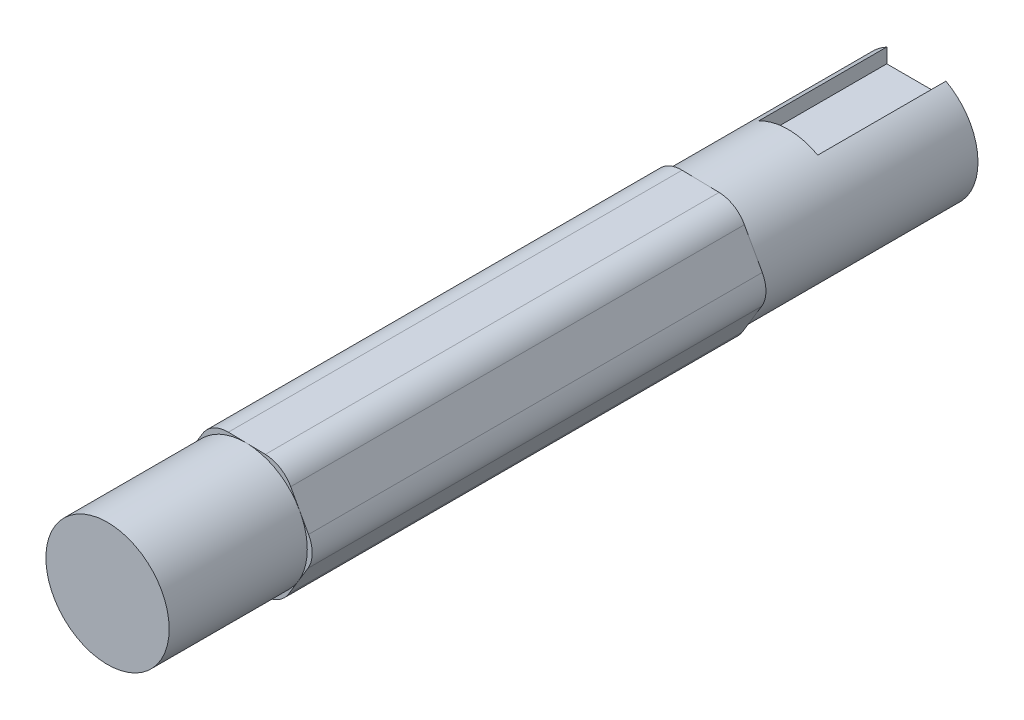
ISO-10303-21;
HEADER;
FILE_DESCRIPTION(('STEP AP214'),'2;1');
FILE_NAME('part.step','',(''),(''),'','','');
FILE_SCHEMA(('AUTOMOTIVE_DESIGN { 1 0 10303 214 1 1 1 1 }'));
ENDSEC;
DATA;
#1=APPLICATION_CONTEXT('core data for automotive mechanical design processes');
#2=APPLICATION_PROTOCOL_DEFINITION('international standard','automotive_design',2000,#1);
#3=PRODUCT_CONTEXT('',#1,'mechanical');
#4=PRODUCT('Part','Part','',(#3));
#5=PRODUCT_RELATED_PRODUCT_CATEGORY('part','',(#4));
#6=PRODUCT_DEFINITION_FORMATION('','',#4);
#7=PRODUCT_DEFINITION_CONTEXT('part definition',#1,'design');
#8=PRODUCT_DEFINITION('design','',#6,#7);
#9=PRODUCT_DEFINITION_SHAPE('','',#8);
#10=(LENGTH_UNIT() NAMED_UNIT(*) SI_UNIT(.MILLI.,.METRE.));
#11=(NAMED_UNIT(*) PLANE_ANGLE_UNIT() SI_UNIT($,.RADIAN.));
#12=(NAMED_UNIT(*) SI_UNIT($,.STERADIAN.) SOLID_ANGLE_UNIT());
#13=UNCERTAINTY_MEASURE_WITH_UNIT(LENGTH_MEASURE(1.E-05),#10,'distance_accuracy_value','');
#14=(GEOMETRIC_REPRESENTATION_CONTEXT(3) GLOBAL_UNCERTAINTY_ASSIGNED_CONTEXT((#13)) GLOBAL_UNIT_ASSIGNED_CONTEXT((#10,
#11,#12)) REPRESENTATION_CONTEXT('',''));
#15=CARTESIAN_POINT('',(0.,0.,0.));
#16=DIRECTION('',(0.,0.,1.));
#17=DIRECTION('',(1.,0.,0.));
#18=AXIS2_PLACEMENT_3D('',#15,#16,#17);
#19=CARTESIAN_POINT('',(0.,0.,-45.));
#20=DIRECTION('',(0.,0.,1.));
#21=DIRECTION('',(1.,0.,0.));
#22=AXIS2_PLACEMENT_3D('',#19,#20,#21);
#23=CYLINDRICAL_SURFACE('',#22,6.25);
#24=DIRECTION('',(0.,0.,1.));
#25=VECTOR('',#24,1.);
#26=CARTESIAN_POINT('',(3.,5.48292804986533,-45.));
#27=LINE('',#26,#25);
#28=CARTESIAN_POINT('',(3.,5.48292804986533,-32.));
#29=VERTEX_POINT('',#28);
#30=CARTESIAN_POINT('',(3.,5.48292804986533,-45.));
#31=VERTEX_POINT('',#30);
#32=EDGE_CURVE('E253',#29,#31,#27,.F.);
#33=ORIENTED_EDGE('',*,*,#32,.F.);
#34=CARTESIAN_POINT('',(0.,0.,-32.));
#35=DIRECTION('',(0.,0.,-1.));
#36=DIRECTION('',(-1.,0.,0.));
#37=AXIS2_PLACEMENT_3D('',#34,#35,#36);
#38=CIRCLE('',#37,6.25);
#39=CARTESIAN_POINT('',(-3.,5.48292804986533,-32.));
#40=VERTEX_POINT('',#39);
#41=EDGE_CURVE('E223',#29,#40,#38,.F.);
#42=ORIENTED_EDGE('',*,*,#41,.T.);
#43=DIRECTION('',(0.,0.,1.));
#44=VECTOR('',#43,1.);
#45=CARTESIAN_POINT('',(-3.,5.48292804986533,-45.));
#46=LINE('',#45,#44);
#47=CARTESIAN_POINT('',(-3.,5.48292804986533,-45.));
#48=VERTEX_POINT('',#47);
#49=EDGE_CURVE('E250',#48,#40,#46,.T.);
#50=ORIENTED_EDGE('',*,*,#49,.F.);
#51=CARTESIAN_POINT('',(0.,0.,-45.));
#52=DIRECTION('',(0.,0.,1.));
#53=DIRECTION('',(1.,0.,0.));
#54=AXIS2_PLACEMENT_3D('',#51,#52,#53);
#55=CIRCLE('',#54,6.25);
#56=EDGE_CURVE('E258',#48,#31,#55,.T.);
#57=ORIENTED_EDGE('',*,*,#56,.T.);
#58=EDGE_LOOP('',(#33,#42,#50,#57));
#59=FACE_BOUND('',#58,.T.);
#60=CARTESIAN_POINT('',(0.,0.,-23.));
#61=DIRECTION('',(0.,0.,1.));
#62=DIRECTION('',(1.,0.,0.));
#63=AXIS2_PLACEMENT_3D('',#60,#61,#62);
#64=CIRCLE('',#63,6.25);
#65=CARTESIAN_POINT('',(5.4741641454902,3.01596202035596,-23.));
#66=VERTEX_POINT('',#65);
#67=CARTESIAN_POINT('',(5.3489817992224,-3.23278420430246,-23.));
#68=VERTEX_POINT('',#67);
#69=EDGE_CURVE('E214',#66,#68,#64,.F.);
#70=ORIENTED_EDGE('',*,*,#69,.T.);
#71=CARTESIAN_POINT('',(-0.125182346267798,-6.24874622465843,-23.));
#72=VERTEX_POINT('',#71);
#73=EDGE_CURVE('E269',#68,#72,#64,.F.);
#74=ORIENTED_EDGE('',*,*,#73,.T.);
#75=CARTESIAN_POINT('',(-5.47416414549019,-3.01596202035596,-23.));
#76=VERTEX_POINT('',#75);
#77=EDGE_CURVE('E479',#72,#76,#64,.F.);
#78=ORIENTED_EDGE('',*,*,#77,.T.);
#79=CARTESIAN_POINT('',(-5.3489817992224,3.23278420430246,-23.));
#80=VERTEX_POINT('',#79);
#81=EDGE_CURVE('E486',#76,#80,#64,.F.);
#82=ORIENTED_EDGE('',*,*,#81,.T.);
#83=CARTESIAN_POINT('',(0.125182346267799,6.24874622465842,-23.));
#84=VERTEX_POINT('',#83);
#85=EDGE_CURVE('E458',#80,#84,#64,.F.);
#86=ORIENTED_EDGE('',*,*,#85,.T.);
#87=EDGE_CURVE('E268',#84,#66,#64,.F.);
#88=ORIENTED_EDGE('',*,*,#87,.T.);
#89=EDGE_LOOP('',(#70,#74,#78,#82,#86,#88));
#90=FACE_BOUND('',#89,.T.);
#91=ADVANCED_FACE('F38',(#59,#90),#23,.T.);
#92=CARTESIAN_POINT('',(0.,0.,-45.));
#93=DIRECTION('',(0.,0.,1.));
#94=DIRECTION('',(1.,0.,0.));
#95=AXIS2_PLACEMENT_3D('',#92,#93,#94);
#96=PLANE('',#95);
#97=DIRECTION('',(-1.,0.,0.));
#98=VECTOR('',#97,1.);
#99=CARTESIAN_POINT('',(3.,4.,-45.));
#100=LINE('',#99,#98);
#101=CARTESIAN_POINT('',(3.,4.,-45.));
#102=VERTEX_POINT('',#101);
#103=CARTESIAN_POINT('',(-3.,4.,-45.));
#104=VERTEX_POINT('',#103);
#105=EDGE_CURVE('E243',#102,#104,#100,.T.);
#106=ORIENTED_EDGE('',*,*,#105,.F.);
#107=DIRECTION('',(0.,1.,0.));
#108=VECTOR('',#107,1.);
#109=CARTESIAN_POINT('',(3.,0.,-45.));
#110=LINE('',#109,#108);
#111=EDGE_CURVE('E261',#102,#31,#110,.T.);
#112=ORIENTED_EDGE('',*,*,#111,.T.);
#113=ORIENTED_EDGE('',*,*,#56,.F.);
#114=DIRECTION('',(0.,1.,0.));
#115=VECTOR('',#114,1.);
#116=CARTESIAN_POINT('',(-3.,8.5,-45.));
#117=LINE('',#116,#115);
#118=EDGE_CURVE('E236',#104,#48,#117,.T.);
#119=ORIENTED_EDGE('',*,*,#118,.F.);
#120=EDGE_LOOP('',(#106,#112,#113,#119));
#121=FACE_BOUND('',#120,.T.);
#122=ADVANCED_FACE('F332',(#121),#96,.F.);
#123=CARTESIAN_POINT('',(3.,8.5,-32.));
#124=DIRECTION('',(1.,0.,0.));
#125=DIRECTION('',(0.,0.,-1.));
#126=AXIS2_PLACEMENT_3D('',#123,#124,#125);
#127=PLANE('',#126);
#128=ORIENTED_EDGE('',*,*,#32,.T.);
#129=ORIENTED_EDGE('',*,*,#111,.F.);
#130=DIRECTION('',(0.,0.,-1.));
#131=VECTOR('',#130,1.);
#132=CARTESIAN_POINT('',(3.,4.,-32.));
#133=LINE('',#132,#131);
#134=CARTESIAN_POINT('',(3.,4.,-32.));
#135=VERTEX_POINT('',#134);
#136=EDGE_CURVE('E242',#135,#102,#133,.T.);
#137=ORIENTED_EDGE('',*,*,#136,.F.);
#138=DIRECTION('',(0.,-1.,0.));
#139=VECTOR('',#138,1.);
#140=CARTESIAN_POINT('',(3.,8.5,-32.));
#141=LINE('',#140,#139);
#142=EDGE_CURVE('E233',#29,#135,#141,.T.);
#143=ORIENTED_EDGE('',*,*,#142,.F.);
#144=EDGE_LOOP('',(#128,#129,#137,#143));
#145=FACE_BOUND('',#144,.T.);
#146=ADVANCED_FACE('F338',(#145),#127,.F.);
#147=CARTESIAN_POINT('',(-3.,8.5,-32.));
#148=DIRECTION('',(-1.,0.,0.));
#149=DIRECTION('',(0.,0.,1.));
#150=AXIS2_PLACEMENT_3D('',#147,#148,#149);
#151=PLANE('',#150);
#152=ORIENTED_EDGE('',*,*,#49,.T.);
#153=DIRECTION('',(0.,1.,0.));
#154=VECTOR('',#153,1.);
#155=CARTESIAN_POINT('',(-3.,8.5,-32.));
#156=LINE('',#155,#154);
#157=CARTESIAN_POINT('',(-3.,4.,-32.));
#158=VERTEX_POINT('',#157);
#159=EDGE_CURVE('E239',#158,#40,#156,.T.);
#160=ORIENTED_EDGE('',*,*,#159,.F.);
#161=DIRECTION('',(0.,0.,-1.));
#162=VECTOR('',#161,1.);
#163=CARTESIAN_POINT('',(-3.,4.,-32.));
#164=LINE('',#163,#162);
#165=EDGE_CURVE('E248',#158,#104,#164,.T.);
#166=ORIENTED_EDGE('',*,*,#165,.T.);
#167=ORIENTED_EDGE('',*,*,#118,.T.);
#168=EDGE_LOOP('',(#152,#160,#166,#167));
#169=FACE_BOUND('',#168,.T.);
#170=ADVANCED_FACE('F364',(#169),#151,.F.);
#171=CARTESIAN_POINT('',(3.,4.,-32.));
#172=DIRECTION('',(0.,-1.,0.));
#173=DIRECTION('',(0.,0.,-1.));
#174=AXIS2_PLACEMENT_3D('',#171,#172,#173);
#175=PLANE('',#174);
#176=ORIENTED_EDGE('',*,*,#105,.T.);
#177=ORIENTED_EDGE('',*,*,#165,.F.);
#178=DIRECTION('',(-1.,0.,0.));
#179=VECTOR('',#178,1.);
#180=CARTESIAN_POINT('',(3.,4.,-32.));
#181=LINE('',#180,#179);
#182=EDGE_CURVE('E235',#135,#158,#181,.T.);
#183=ORIENTED_EDGE('',*,*,#182,.F.);
#184=ORIENTED_EDGE('',*,*,#136,.T.);
#185=EDGE_LOOP('',(#176,#177,#183,#184));
#186=FACE_BOUND('',#185,.T.);
#187=ADVANCED_FACE('F366',(#186),#175,.F.);
#188=CARTESIAN_POINT('',(0.,0.,-32.));
#189=DIRECTION('',(0.,0.,-1.));
#190=DIRECTION('',(-1.,0.,0.));
#191=AXIS2_PLACEMENT_3D('',#188,#189,#190);
#192=PLANE('',#191);
#193=ORIENTED_EDGE('',*,*,#142,.T.);
#194=ORIENTED_EDGE('',*,*,#182,.T.);
#195=ORIENTED_EDGE('',*,*,#159,.T.);
#196=ORIENTED_EDGE('',*,*,#41,.F.);
#197=EDGE_LOOP('',(#193,#194,#195,#196));
#198=FACE_BOUND('',#197,.T.);
#199=ADVANCED_FACE('F369',(#198),#192,.T.);
#200=CARTESIAN_POINT('',(7.2154306298084,-0.144548122631002,42.1851751755642));
#201=DIRECTION('',(-0.875866263278431,-0.482553923256953,0.));
#202=DIRECTION('',(0.482553923256953,-0.875866263278431,0.));
#203=AXIS2_PLACEMENT_3D('',#200,#201,#202);
#204=PLANE('',#203);
#205=DIRECTION('',(-0.482553923256953,0.875866263278431,0.));
#206=VECTOR('',#205,1.);
#207=CARTESIAN_POINT('',(7.2154306298084,-0.144548122631002,23.));
#208=LINE('',#207,#206);
#209=CARTESIAN_POINT('',(6.37962271733566,1.37249674600274,23.));
#210=VERTEX_POINT('',#209);
#211=CARTESIAN_POINT('',(5.4741641454902,3.01596202035596,23.));
#212=VERTEX_POINT('',#211);
#213=EDGE_CURVE('E221',#210,#212,#208,.T.);
#214=ORIENTED_EDGE('',*,*,#213,.F.);
#215=DIRECTION('',(0.,0.,-1.));
#216=VECTOR('',#215,1.);
#217=CARTESIAN_POINT('',(6.37962271733566,1.37249674600274,42.1851751755642));
#218=LINE('',#217,#216);
#219=CARTESIAN_POINT('',(6.37962271733566,1.37249674600274,-23.));
#220=VERTEX_POINT('',#219);
#221=EDGE_CURVE('E310',#210,#220,#218,.T.);
#222=ORIENTED_EDGE('',*,*,#221,.T.);
#223=DIRECTION('',(-0.482553923256953,0.875866263278431,0.));
#224=VECTOR('',#223,1.);
#225=CARTESIAN_POINT('',(7.2154306298084,-0.144548122631002,-23.));
#226=LINE('',#225,#224);
#227=EDGE_CURVE('E429',#220,#66,#226,.T.);
#228=ORIENTED_EDGE('',*,*,#227,.T.);
#229=CARTESIAN_POINT('',(4.56870557364473,4.65942729470918,-23.));
#230=VERTEX_POINT('',#229);
#231=EDGE_CURVE('E433',#66,#230,#226,.T.);
#232=ORIENTED_EDGE('',*,*,#231,.T.);
#233=DIRECTION('',(0.,0.,-1.));
#234=VECTOR('',#233,1.);
#235=CARTESIAN_POINT('',(4.56870557364473,4.65942729470918,42.1851751755642));
#236=LINE('',#235,#234);
#237=CARTESIAN_POINT('',(4.56870557364473,4.65942729470918,23.));
#238=VERTEX_POINT('',#237);
#239=EDGE_CURVE('E308',#230,#238,#236,.F.);
#240=ORIENTED_EDGE('',*,*,#239,.T.);
#241=EDGE_CURVE('E199',#212,#238,#208,.T.);
#242=ORIENTED_EDGE('',*,*,#241,.F.);
#243=EDGE_LOOP('',(#214,#222,#228,#232,#240,#242));
#244=FACE_BOUND('',#243,.T.);
#245=ADVANCED_FACE('F316',(#244),#204,.F.);
#246=CARTESIAN_POINT('',(3.732897661172,6.17647216334292,42.1851751755642));
#247=DIRECTION('',(-0.0200291754028479,-0.999799395945348,0.));
#248=DIRECTION('',(0.999799395945348,-0.0200291754028479,0.));
#249=AXIS2_PLACEMENT_3D('',#246,#247,#248);
#250=PLANE('',#249);
#251=DIRECTION('',(-0.999799395945348,0.0200291754028479,0.));
#252=VECTOR('',#251,1.);
#253=CARTESIAN_POINT('',(3.732897661172,6.17647216334292,-23.));
#254=LINE('',#253,#252);
#255=CARTESIAN_POINT('',(-1.75082961748238,6.28632873654248,-23.));
#256=VERTEX_POINT('',#255);
#257=EDGE_CURVE('E424',#84,#256,#254,.T.);
#258=ORIENTED_EDGE('',*,*,#257,.T.);
#259=DIRECTION('',(0.,0.,-1.));
#260=VECTOR('',#259,1.);
#261=CARTESIAN_POINT('',(-1.75082961748238,6.28632873654248,42.1851751755642));
#262=LINE('',#261,#260);
#263=CARTESIAN_POINT('',(-1.75082961748238,6.28632873654248,23.));
#264=VERTEX_POINT('',#263);
#265=EDGE_CURVE('E280',#256,#264,#262,.F.);
#266=ORIENTED_EDGE('',*,*,#265,.T.);
#267=DIRECTION('',(-0.999799395945348,0.0200291754028479,0.));
#268=VECTOR('',#267,1.);
#269=CARTESIAN_POINT('',(3.732897661172,6.17647216334292,23.));
#270=LINE('',#269,#268);
#271=CARTESIAN_POINT('',(0.125182346267799,6.24874622465842,23.));
#272=VERTEX_POINT('',#271);
#273=EDGE_CURVE('E319',#272,#264,#270,.T.);
#274=ORIENTED_EDGE('',*,*,#273,.F.);
#275=CARTESIAN_POINT('',(2.00119431001798,6.21116371277436,23.));
#276=VERTEX_POINT('',#275);
#277=EDGE_CURVE('E441',#276,#272,#270,.T.);
#278=ORIENTED_EDGE('',*,*,#277,.F.);
#279=DIRECTION('',(0.,0.,-1.));
#280=VECTOR('',#279,1.);
#281=CARTESIAN_POINT('',(2.00119431001798,6.21116371277436,42.1851751755642));
#282=LINE('',#281,#280);
#283=CARTESIAN_POINT('',(2.00119431001798,6.21116371277436,-23.));
#284=VERTEX_POINT('',#283);
#285=EDGE_CURVE('E277',#276,#284,#282,.T.);
#286=ORIENTED_EDGE('',*,*,#285,.T.);
#287=EDGE_CURVE('E419',#284,#84,#254,.T.);
#288=ORIENTED_EDGE('',*,*,#287,.T.);
#289=EDGE_LOOP('',(#258,#266,#274,#278,#286,#288));
#290=FACE_BOUND('',#289,.T.);
#291=ADVANCED_FACE('F379',(#290),#250,.F.);
#292=CARTESIAN_POINT('',(-3.4825329686364,6.32102028597393,42.1851751755642));
#293=DIRECTION('',(0.855837087875584,-0.517245472688394,0.));
#294=DIRECTION('',(0.517245472688394,0.855837087875584,0.));
#295=AXIS2_PLACEMENT_3D('',#292,#293,#294);
#296=PLANE('',#295);
#297=DIRECTION('',(-0.517245472688394,-0.855837087875584,0.));
#298=VECTOR('',#297,1.);
#299=CARTESIAN_POINT('',(-3.4825329686364,6.32102028597393,23.));
#300=LINE('',#299,#298);
#301=CARTESIAN_POINT('',(-4.37842840731768,4.83866696677162,23.));
#302=VERTEX_POINT('',#301);
#303=CARTESIAN_POINT('',(-5.3489817992224,3.23278420430246,23.));
#304=VERTEX_POINT('',#303);
#305=EDGE_CURVE('E439',#302,#304,#300,.T.);
#306=ORIENTED_EDGE('',*,*,#305,.F.);
#307=DIRECTION('',(0.,0.,-1.));
#308=VECTOR('',#307,1.);
#309=CARTESIAN_POINT('',(-4.37842840731768,4.83866696677162,42.1851751755642));
#310=LINE('',#309,#308);
#311=CARTESIAN_POINT('',(-4.37842840731768,4.83866696677162,-23.));
#312=VERTEX_POINT('',#311);
#313=EDGE_CURVE('E272',#302,#312,#310,.T.);
#314=ORIENTED_EDGE('',*,*,#313,.T.);
#315=DIRECTION('',(-0.517245472688394,-0.855837087875584,0.));
#316=VECTOR('',#315,1.);
#317=CARTESIAN_POINT('',(-3.4825329686364,6.32102028597393,-23.));
#318=LINE('',#317,#316);
#319=EDGE_CURVE('E427',#312,#80,#318,.T.);
#320=ORIENTED_EDGE('',*,*,#319,.T.);
#321=CARTESIAN_POINT('',(-6.31953519112711,1.6269014418333,-23.));
#322=VERTEX_POINT('',#321);
#323=EDGE_CURVE('E423',#80,#322,#318,.T.);
#324=ORIENTED_EDGE('',*,*,#323,.T.);
#325=DIRECTION('',(0.,0.,-1.));
#326=VECTOR('',#325,1.);
#327=CARTESIAN_POINT('',(-6.31953519112711,1.6269014418333,42.1851751755642));
#328=LINE('',#327,#326);
#329=CARTESIAN_POINT('',(-6.31953519112711,1.6269014418333,23.));
#330=VERTEX_POINT('',#329);
#331=EDGE_CURVE('E270',#322,#330,#328,.F.);
#332=ORIENTED_EDGE('',*,*,#331,.T.);
#333=EDGE_CURVE('E440',#304,#330,#300,.T.);
#334=ORIENTED_EDGE('',*,*,#333,.F.);
#335=EDGE_LOOP('',(#306,#314,#320,#324,#332,#334));
#336=FACE_BOUND('',#335,.T.);
#337=ADVANCED_FACE('F382',(#336),#296,.F.);
#338=CARTESIAN_POINT('',(-7.21543062980839,0.144548122631002,42.1851751755642));
#339=DIRECTION('',(0.875866263278431,0.482553923256954,0.));
#340=DIRECTION('',(-0.482553923256954,0.875866263278431,0.));
#341=AXIS2_PLACEMENT_3D('',#338,#339,#340);
#342=PLANE('',#341);
#343=DIRECTION('',(0.482553923256954,-0.875866263278431,0.));
#344=VECTOR('',#343,1.);
#345=CARTESIAN_POINT('',(-7.21543062980839,0.144548122631002,23.));
#346=LINE('',#345,#344);
#347=CARTESIAN_POINT('',(-6.37962271733566,-1.37249674600274,23.));
#348=VERTEX_POINT('',#347);
#349=CARTESIAN_POINT('',(-5.47416414549019,-3.01596202035596,23.));
#350=VERTEX_POINT('',#349);
#351=EDGE_CURVE('E436',#348,#350,#346,.T.);
#352=ORIENTED_EDGE('',*,*,#351,.F.);
#353=DIRECTION('',(0.,0.,-1.));
#354=VECTOR('',#353,1.);
#355=CARTESIAN_POINT('',(-6.37962271733566,-1.37249674600274,42.1851751755642));
#356=LINE('',#355,#354);
#357=CARTESIAN_POINT('',(-6.37962271733566,-1.37249674600274,-23.));
#358=VERTEX_POINT('',#357);
#359=EDGE_CURVE('E286',#348,#358,#356,.T.);
#360=ORIENTED_EDGE('',*,*,#359,.T.);
#361=DIRECTION('',(0.482553923256954,-0.875866263278431,0.));
#362=VECTOR('',#361,1.);
#363=CARTESIAN_POINT('',(-7.21543062980839,0.144548122631002,-23.));
#364=LINE('',#363,#362);
#365=EDGE_CURVE('E462',#358,#76,#364,.T.);
#366=ORIENTED_EDGE('',*,*,#365,.T.);
#367=CARTESIAN_POINT('',(-4.56870557364473,-4.65942729470918,-23.));
#368=VERTEX_POINT('',#367);
#369=EDGE_CURVE('E460',#76,#368,#364,.T.);
#370=ORIENTED_EDGE('',*,*,#369,.T.);
#371=DIRECTION('',(0.,0.,-1.));
#372=VECTOR('',#371,1.);
#373=CARTESIAN_POINT('',(-4.56870557364473,-4.65942729470918,42.1851751755642));
#374=LINE('',#373,#372);
#375=CARTESIAN_POINT('',(-4.56870557364473,-4.65942729470918,23.));
#376=VERTEX_POINT('',#375);
#377=EDGE_CURVE('E284',#368,#376,#374,.F.);
#378=ORIENTED_EDGE('',*,*,#377,.T.);
#379=EDGE_CURVE('E438',#350,#376,#346,.T.);
#380=ORIENTED_EDGE('',*,*,#379,.F.);
#381=EDGE_LOOP('',(#352,#360,#366,#370,#378,#380));
#382=FACE_BOUND('',#381,.T.);
#383=ADVANCED_FACE('F386',(#382),#342,.F.);
#384=CARTESIAN_POINT('',(-3.73289766117199,-6.17647216334292,42.1851751755642));
#385=DIRECTION('',(0.0200291754028477,0.999799395945348,0.));
#386=DIRECTION('',(-0.999799395945348,0.0200291754028477,0.));
#387=AXIS2_PLACEMENT_3D('',#384,#385,#386);
#388=PLANE('',#387);
#389=DIRECTION('',(0.999799395945348,-0.0200291754028477,0.));
#390=VECTOR('',#389,1.);
#391=CARTESIAN_POINT('',(-3.73289766117199,-6.17647216334292,23.));
#392=LINE('',#391,#390);
#393=CARTESIAN_POINT('',(-2.00119431001797,-6.21116371277436,23.));
#394=VERTEX_POINT('',#393);
#395=CARTESIAN_POINT('',(-0.125182346267798,-6.24874622465843,23.));
#396=VERTEX_POINT('',#395);
#397=EDGE_CURVE('E246',#394,#396,#392,.T.);
#398=ORIENTED_EDGE('',*,*,#397,.F.);
#399=DIRECTION('',(0.,0.,-1.));
#400=VECTOR('',#399,1.);
#401=CARTESIAN_POINT('',(-2.00119431001797,-6.21116371277436,42.1851751755642));
#402=LINE('',#401,#400);
#403=CARTESIAN_POINT('',(-2.00119431001797,-6.21116371277436,-23.));
#404=VERTEX_POINT('',#403);
#405=EDGE_CURVE('E295',#394,#404,#402,.T.);
#406=ORIENTED_EDGE('',*,*,#405,.T.);
#407=DIRECTION('',(0.999799395945348,-0.0200291754028477,0.));
#408=VECTOR('',#407,1.);
#409=CARTESIAN_POINT('',(-3.73289766117199,-6.17647216334292,-23.));
#410=LINE('',#409,#408);
#411=EDGE_CURVE('E467',#404,#72,#410,.T.);
#412=ORIENTED_EDGE('',*,*,#411,.T.);
#413=CARTESIAN_POINT('',(1.75082961748238,-6.28632873654249,-23.));
#414=VERTEX_POINT('',#413);
#415=EDGE_CURVE('E465',#72,#414,#410,.T.);
#416=ORIENTED_EDGE('',*,*,#415,.T.);
#417=DIRECTION('',(0.,0.,-1.));
#418=VECTOR('',#417,1.);
#419=CARTESIAN_POINT('',(1.75082961748238,-6.28632873654249,42.1851751755642));
#420=LINE('',#419,#418);
#421=CARTESIAN_POINT('',(1.75082961748238,-6.28632873654249,23.));
#422=VERTEX_POINT('',#421);
#423=EDGE_CURVE('E293',#414,#422,#420,.F.);
#424=ORIENTED_EDGE('',*,*,#423,.T.);
#425=EDGE_CURVE('E435',#396,#422,#392,.T.);
#426=ORIENTED_EDGE('',*,*,#425,.F.);
#427=EDGE_LOOP('',(#398,#406,#412,#416,#424,#426));
#428=FACE_BOUND('',#427,.T.);
#429=ADVANCED_FACE('F390',(#428),#388,.F.);
#430=CARTESIAN_POINT('',(3.4825329686364,-6.32102028597393,42.1851751755642));
#431=DIRECTION('',(-0.855837087875584,0.517245472688394,0.));
#432=DIRECTION('',(-0.517245472688394,-0.855837087875584,0.));
#433=AXIS2_PLACEMENT_3D('',#430,#431,#432);
#434=PLANE('',#433);
#435=DIRECTION('',(0.517245472688394,0.855837087875584,0.));
#436=VECTOR('',#435,1.);
#437=CARTESIAN_POINT('',(3.4825329686364,-6.32102028597393,23.));
#438=LINE('',#437,#436);
#439=CARTESIAN_POINT('',(4.37842840731768,-4.83866696677163,23.));
#440=VERTEX_POINT('',#439);
#441=CARTESIAN_POINT('',(5.3489817992224,-3.23278420430246,23.));
#442=VERTEX_POINT('',#441);
#443=EDGE_CURVE('E187',#440,#442,#438,.T.);
#444=ORIENTED_EDGE('',*,*,#443,.F.);
#445=DIRECTION('',(0.,0.,-1.));
#446=VECTOR('',#445,1.);
#447=CARTESIAN_POINT('',(4.37842840731768,-4.83866696677163,42.1851751755642));
#448=LINE('',#447,#446);
#449=CARTESIAN_POINT('',(4.37842840731768,-4.83866696677163,-23.));
#450=VERTEX_POINT('',#449);
#451=EDGE_CURVE('E303',#440,#450,#448,.T.);
#452=ORIENTED_EDGE('',*,*,#451,.T.);
#453=DIRECTION('',(0.517245472688394,0.855837087875584,0.));
#454=VECTOR('',#453,1.);
#455=CARTESIAN_POINT('',(3.4825329686364,-6.32102028597393,-23.));
#456=LINE('',#455,#454);
#457=EDGE_CURVE('E227',#450,#68,#456,.T.);
#458=ORIENTED_EDGE('',*,*,#457,.T.);
#459=CARTESIAN_POINT('',(6.31953519112712,-1.6269014418333,-23.));
#460=VERTEX_POINT('',#459);
#461=EDGE_CURVE('E228',#68,#460,#456,.T.);
#462=ORIENTED_EDGE('',*,*,#461,.T.);
#463=DIRECTION('',(0.,0.,-1.));
#464=VECTOR('',#463,1.);
#465=CARTESIAN_POINT('',(6.31953519112712,-1.6269014418333,42.1851751755642));
#466=LINE('',#465,#464);
#467=CARTESIAN_POINT('',(6.31953519112712,-1.6269014418333,23.));
#468=VERTEX_POINT('',#467);
#469=EDGE_CURVE('E226',#460,#468,#466,.F.);
#470=ORIENTED_EDGE('',*,*,#469,.T.);
#471=EDGE_CURVE('E200',#442,#468,#438,.T.);
#472=ORIENTED_EDGE('',*,*,#471,.F.);
#473=EDGE_LOOP('',(#444,#452,#458,#462,#470,#472));
#474=FACE_BOUND('',#473,.T.);
#475=ADVANCED_FACE('F224',(#474),#434,.F.);
#476=CARTESIAN_POINT('',(0.,0.,-23.));
#477=DIRECTION('',(0.,0.,1.));
#478=DIRECTION('',(1.,0.,0.));
#479=AXIS2_PLACEMENT_3D('',#476,#477,#478);
#480=PLANE('',#479);
#481=ORIENTED_EDGE('',*,*,#457,.F.);
#482=CARTESIAN_POINT('',(1.81091714369093,-3.28693054870644,-23.));
#483=DIRECTION('',(0.,0.,1.));
#484=DIRECTION('',(1.,0.,0.));
#485=AXIS2_PLACEMENT_3D('',#482,#483,#484);
#486=CIRCLE('',#485,3.);
#487=EDGE_CURVE('E305',#450,#414,#486,.F.);
#488=ORIENTED_EDGE('',*,*,#487,.T.);
#489=ORIENTED_EDGE('',*,*,#415,.F.);
#490=ORIENTED_EDGE('',*,*,#73,.F.);
#491=EDGE_LOOP('',(#481,#488,#489,#490));
#492=FACE_BOUND('',#491,.T.);
#493=ADVANCED_FACE('F397',(#492),#480,.F.);
#494=ORIENTED_EDGE('',*,*,#411,.F.);
#495=CARTESIAN_POINT('',(-1.94110678380943,-3.21176552493832,-23.));
#496=DIRECTION('',(0.,0.,1.));
#497=DIRECTION('',(1.,0.,0.));
#498=AXIS2_PLACEMENT_3D('',#495,#496,#497);
#499=CIRCLE('',#498,3.);
#500=EDGE_CURVE('E298',#404,#368,#499,.F.);
#501=ORIENTED_EDGE('',*,*,#500,.T.);
#502=ORIENTED_EDGE('',*,*,#369,.F.);
#503=ORIENTED_EDGE('',*,*,#77,.F.);
#504=EDGE_LOOP('',(#494,#501,#502,#503));
#505=FACE_BOUND('',#504,.T.);
#506=ADVANCED_FACE('F407',(#505),#480,.F.);
#507=ORIENTED_EDGE('',*,*,#365,.F.);
#508=CARTESIAN_POINT('',(-3.75202392750036,0.0751650237681221,-23.));
#509=DIRECTION('',(0.,0.,1.));
#510=DIRECTION('',(1.,0.,0.));
#511=AXIS2_PLACEMENT_3D('',#508,#509,#510);
#512=CIRCLE('',#511,3.);
#513=EDGE_CURVE('E289',#358,#322,#512,.F.);
#514=ORIENTED_EDGE('',*,*,#513,.T.);
#515=ORIENTED_EDGE('',*,*,#323,.F.);
#516=ORIENTED_EDGE('',*,*,#81,.F.);
#517=EDGE_LOOP('',(#507,#514,#515,#516));
#518=FACE_BOUND('',#517,.T.);
#519=ADVANCED_FACE('F416',(#518),#480,.F.);
#520=ORIENTED_EDGE('',*,*,#319,.F.);
#521=CARTESIAN_POINT('',(-1.81091714369093,3.28693054870644,-23.));
#522=DIRECTION('',(0.,0.,1.));
#523=DIRECTION('',(1.,0.,0.));
#524=AXIS2_PLACEMENT_3D('',#521,#522,#523);
#525=CIRCLE('',#524,3.);
#526=EDGE_CURVE('E275',#312,#256,#525,.F.);
#527=ORIENTED_EDGE('',*,*,#526,.T.);
#528=ORIENTED_EDGE('',*,*,#257,.F.);
#529=ORIENTED_EDGE('',*,*,#85,.F.);
#530=EDGE_LOOP('',(#520,#527,#528,#529));
#531=FACE_BOUND('',#530,.T.);
#532=ADVANCED_FACE('F410',(#531),#480,.F.);
#533=ORIENTED_EDGE('',*,*,#287,.F.);
#534=CARTESIAN_POINT('',(1.94110678380944,3.21176552493832,-23.));
#535=DIRECTION('',(0.,0.,1.));
#536=DIRECTION('',(1.,0.,0.));
#537=AXIS2_PLACEMENT_3D('',#534,#535,#536);
#538=CIRCLE('',#537,3.);
#539=EDGE_CURVE('E46',#284,#230,#538,.F.);
#540=ORIENTED_EDGE('',*,*,#539,.T.);
#541=ORIENTED_EDGE('',*,*,#231,.F.);
#542=ORIENTED_EDGE('',*,*,#87,.F.);
#543=EDGE_LOOP('',(#533,#540,#541,#542));
#544=FACE_BOUND('',#543,.T.);
#545=ADVANCED_FACE('F400',(#544),#480,.F.);
#546=CARTESIAN_POINT('',(0.,0.,23.));
#547=DIRECTION('',(0.,0.,1.));
#548=DIRECTION('',(1.,0.,0.));
#549=AXIS2_PLACEMENT_3D('',#546,#547,#548);
#550=PLANE('',#549);
#551=ORIENTED_EDGE('',*,*,#425,.T.);
#552=CARTESIAN_POINT('',(1.81091714369093,-3.28693054870644,23.));
#553=DIRECTION('',(0.,0.,1.));
#554=DIRECTION('',(1.,0.,0.));
#555=AXIS2_PLACEMENT_3D('',#552,#553,#554);
#556=CIRCLE('',#555,3.);
#557=EDGE_CURVE('E194',#422,#440,#556,.T.);
#558=ORIENTED_EDGE('',*,*,#557,.T.);
#559=ORIENTED_EDGE('',*,*,#443,.T.);
#560=CARTESIAN_POINT('',(0.,0.,23.));
#561=DIRECTION('',(0.,0.,1.));
#562=DIRECTION('',(1.,0.,0.));
#563=AXIS2_PLACEMENT_3D('',#560,#561,#562);
#564=CIRCLE('',#563,6.25);
#565=EDGE_CURVE('E191',#442,#396,#564,.F.);
#566=ORIENTED_EDGE('',*,*,#565,.T.);
#567=EDGE_LOOP('',(#551,#558,#559,#566));
#568=FACE_BOUND('',#567,.T.);
#569=ADVANCED_FACE('F190',(#568),#550,.T.);
#570=ORIENTED_EDGE('',*,*,#379,.T.);
#571=CARTESIAN_POINT('',(-1.94110678380943,-3.21176552493832,23.));
#572=DIRECTION('',(0.,0.,1.));
#573=DIRECTION('',(1.,0.,0.));
#574=AXIS2_PLACEMENT_3D('',#571,#572,#573);
#575=CIRCLE('',#574,3.);
#576=EDGE_CURVE('E300',#376,#394,#575,.T.);
#577=ORIENTED_EDGE('',*,*,#576,.T.);
#578=ORIENTED_EDGE('',*,*,#397,.T.);
#579=EDGE_CURVE('E213',#396,#350,#564,.F.);
#580=ORIENTED_EDGE('',*,*,#579,.T.);
#581=EDGE_LOOP('',(#570,#577,#578,#580));
#582=FACE_BOUND('',#581,.T.);
#583=ADVANCED_FACE('F415',(#582),#550,.T.);
#584=ORIENTED_EDGE('',*,*,#333,.T.);
#585=CARTESIAN_POINT('',(-3.75202392750036,0.0751650237681221,23.));
#586=DIRECTION('',(0.,0.,1.));
#587=DIRECTION('',(1.,0.,0.));
#588=AXIS2_PLACEMENT_3D('',#585,#586,#587);
#589=CIRCLE('',#588,3.);
#590=EDGE_CURVE('E291',#330,#348,#589,.T.);
#591=ORIENTED_EDGE('',*,*,#590,.T.);
#592=ORIENTED_EDGE('',*,*,#351,.T.);
#593=EDGE_CURVE('E504',#350,#304,#564,.F.);
#594=ORIENTED_EDGE('',*,*,#593,.T.);
#595=EDGE_LOOP('',(#584,#591,#592,#594));
#596=FACE_BOUND('',#595,.T.);
#597=ADVANCED_FACE('F503',(#596),#550,.T.);
#598=ORIENTED_EDGE('',*,*,#273,.T.);
#599=CARTESIAN_POINT('',(-1.81091714369093,3.28693054870644,23.));
#600=DIRECTION('',(0.,0.,1.));
#601=DIRECTION('',(1.,0.,0.));
#602=AXIS2_PLACEMENT_3D('',#599,#600,#601);
#603=CIRCLE('',#602,3.);
#604=EDGE_CURVE('E282',#264,#302,#603,.T.);
#605=ORIENTED_EDGE('',*,*,#604,.T.);
#606=ORIENTED_EDGE('',*,*,#305,.T.);
#607=EDGE_CURVE('E451',#304,#272,#564,.F.);
#608=ORIENTED_EDGE('',*,*,#607,.T.);
#609=EDGE_LOOP('',(#598,#605,#606,#608));
#610=FACE_BOUND('',#609,.T.);
#611=ADVANCED_FACE('F404',(#610),#550,.T.);
#612=ORIENTED_EDGE('',*,*,#241,.T.);
#613=CARTESIAN_POINT('',(1.94110678380944,3.21176552493832,23.));
#614=DIRECTION('',(0.,0.,1.));
#615=DIRECTION('',(1.,0.,0.));
#616=AXIS2_PLACEMENT_3D('',#613,#614,#615);
#617=CIRCLE('',#616,3.);
#618=EDGE_CURVE('E11',#238,#276,#617,.T.);
#619=ORIENTED_EDGE('',*,*,#618,.T.);
#620=ORIENTED_EDGE('',*,*,#277,.T.);
#621=EDGE_CURVE('E222',#272,#212,#564,.F.);
#622=ORIENTED_EDGE('',*,*,#621,.T.);
#623=EDGE_LOOP('',(#612,#619,#620,#622));
#624=FACE_BOUND('',#623,.T.);
#625=ADVANCED_FACE('F360',(#624),#550,.T.);
#626=ORIENTED_EDGE('',*,*,#227,.F.);
#627=CARTESIAN_POINT('',(3.75202392750036,-0.0751650237681201,-23.));
#628=DIRECTION('',(0.,0.,1.));
#629=DIRECTION('',(1.,0.,0.));
#630=AXIS2_PLACEMENT_3D('',#627,#628,#629);
#631=CIRCLE('',#630,3.);
#632=EDGE_CURVE('E60',#220,#460,#631,.F.);
#633=ORIENTED_EDGE('',*,*,#632,.T.);
#634=ORIENTED_EDGE('',*,*,#461,.F.);
#635=ORIENTED_EDGE('',*,*,#69,.F.);
#636=EDGE_LOOP('',(#626,#633,#634,#635));
#637=FACE_BOUND('',#636,.T.);
#638=ADVANCED_FACE('F358',(#637),#480,.F.);
#639=ORIENTED_EDGE('',*,*,#471,.T.);
#640=CARTESIAN_POINT('',(3.75202392750036,-0.0751650237681201,23.));
#641=DIRECTION('',(0.,0.,1.));
#642=DIRECTION('',(1.,0.,0.));
#643=AXIS2_PLACEMENT_3D('',#640,#641,#642);
#644=CIRCLE('',#643,3.);
#645=EDGE_CURVE('E313',#468,#210,#644,.T.);
#646=ORIENTED_EDGE('',*,*,#645,.T.);
#647=ORIENTED_EDGE('',*,*,#213,.T.);
#648=EDGE_CURVE('E209',#212,#442,#564,.F.);
#649=ORIENTED_EDGE('',*,*,#648,.T.);
#650=EDGE_LOOP('',(#639,#646,#647,#649));
#651=FACE_BOUND('',#650,.T.);
#652=ADVANCED_FACE('F218',(#651),#550,.T.);
#653=CARTESIAN_POINT('',(0.,0.,37.));
#654=DIRECTION('',(0.,0.,1.));
#655=DIRECTION('',(1.,0.,0.));
#656=AXIS2_PLACEMENT_3D('',#653,#654,#655);
#657=PLANE('',#656);
#658=CARTESIAN_POINT('',(0.,0.,37.));
#659=DIRECTION('',(0.,0.,1.));
#660=DIRECTION('',(1.,0.,0.));
#661=AXIS2_PLACEMENT_3D('',#658,#659,#660);
#662=CIRCLE('',#661,6.25);
#663=CARTESIAN_POINT('',(6.25,0.,37.));
#664=VERTEX_POINT('',#663);
#665=EDGE_CURVE('E255',#664,#664,#662,.T.);
#666=ORIENTED_EDGE('',*,*,#665,.T.);
#667=EDGE_LOOP('',(#666));
#668=FACE_BOUND('',#667,.T.);
#669=ADVANCED_FACE('F346',(#668),#657,.T.);
#670=ORIENTED_EDGE('',*,*,#565,.F.);
#671=ORIENTED_EDGE('',*,*,#648,.F.);
#672=ORIENTED_EDGE('',*,*,#621,.F.);
#673=ORIENTED_EDGE('',*,*,#607,.F.);
#674=ORIENTED_EDGE('',*,*,#593,.F.);
#675=ORIENTED_EDGE('',*,*,#579,.F.);
#676=EDGE_LOOP('',(#670,#671,#672,#673,#674,#675));
#677=FACE_BOUND('',#676,.T.);
#678=ORIENTED_EDGE('',*,*,#665,.F.);
#679=EDGE_LOOP('',(#678));
#680=FACE_BOUND('',#679,.T.);
#681=ADVANCED_FACE('F206',(#677,#680),#23,.T.);
#682=CARTESIAN_POINT('',(-1.81091714369093,3.28693054870644,42.1851751755642));
#683=DIRECTION('',(0.,0.,-1.));
#684=DIRECTION('',(-1.,0.,0.));
#685=AXIS2_PLACEMENT_3D('',#682,#683,#684);
#686=CYLINDRICAL_SURFACE('',#685,3.);
#687=ORIENTED_EDGE('',*,*,#604,.F.);
#688=ORIENTED_EDGE('',*,*,#265,.F.);
#689=ORIENTED_EDGE('',*,*,#526,.F.);
#690=ORIENTED_EDGE('',*,*,#313,.F.);
#691=EDGE_LOOP('',(#687,#688,#689,#690));
#692=FACE_BOUND('',#691,.T.);
#693=ADVANCED_FACE('F345',(#692),#686,.T.);
#694=CARTESIAN_POINT('',(-3.75202392750036,0.0751650237681221,42.1851751755642));
#695=DIRECTION('',(0.,0.,-1.));
#696=DIRECTION('',(-1.,0.,0.));
#697=AXIS2_PLACEMENT_3D('',#694,#695,#696);
#698=CYLINDRICAL_SURFACE('',#697,3.);
#699=ORIENTED_EDGE('',*,*,#590,.F.);
#700=ORIENTED_EDGE('',*,*,#331,.F.);
#701=ORIENTED_EDGE('',*,*,#513,.F.);
#702=ORIENTED_EDGE('',*,*,#359,.F.);
#703=EDGE_LOOP('',(#699,#700,#701,#702));
#704=FACE_BOUND('',#703,.T.);
#705=ADVANCED_FACE('F351',(#704),#698,.T.);
#706=CARTESIAN_POINT('',(-1.94110678380943,-3.21176552493832,42.1851751755642));
#707=DIRECTION('',(0.,0.,-1.));
#708=DIRECTION('',(-1.,0.,0.));
#709=AXIS2_PLACEMENT_3D('',#706,#707,#708);
#710=CYLINDRICAL_SURFACE('',#709,3.);
#711=ORIENTED_EDGE('',*,*,#576,.F.);
#712=ORIENTED_EDGE('',*,*,#377,.F.);
#713=ORIENTED_EDGE('',*,*,#500,.F.);
#714=ORIENTED_EDGE('',*,*,#405,.F.);
#715=EDGE_LOOP('',(#711,#712,#713,#714));
#716=FACE_BOUND('',#715,.T.);
#717=ADVANCED_FACE('F328',(#716),#710,.T.);
#718=CARTESIAN_POINT('',(1.81091714369093,-3.28693054870644,42.1851751755642));
#719=DIRECTION('',(0.,0.,-1.));
#720=DIRECTION('',(-1.,0.,0.));
#721=AXIS2_PLACEMENT_3D('',#718,#719,#720);
#722=CYLINDRICAL_SURFACE('',#721,3.);
#723=ORIENTED_EDGE('',*,*,#557,.F.);
#724=ORIENTED_EDGE('',*,*,#423,.F.);
#725=ORIENTED_EDGE('',*,*,#487,.F.);
#726=ORIENTED_EDGE('',*,*,#451,.F.);
#727=EDGE_LOOP('',(#723,#724,#725,#726));
#728=FACE_BOUND('',#727,.T.);
#729=ADVANCED_FACE('F322',(#728),#722,.T.);
#730=CARTESIAN_POINT('',(3.75202392750036,-0.0751650237681201,42.1851751755642));
#731=DIRECTION('',(0.,0.,-1.));
#732=DIRECTION('',(-1.,0.,0.));
#733=AXIS2_PLACEMENT_3D('',#730,#731,#732);
#734=CYLINDRICAL_SURFACE('',#733,3.);
#735=ORIENTED_EDGE('',*,*,#645,.F.);
#736=ORIENTED_EDGE('',*,*,#469,.F.);
#737=ORIENTED_EDGE('',*,*,#632,.F.);
#738=ORIENTED_EDGE('',*,*,#221,.F.);
#739=EDGE_LOOP('',(#735,#736,#737,#738));
#740=FACE_BOUND('',#739,.T.);
#741=ADVANCED_FACE('F320',(#740),#734,.T.);
#742=CARTESIAN_POINT('',(1.94110678380944,3.21176552493832,42.1851751755642));
#743=DIRECTION('',(0.,0.,-1.));
#744=DIRECTION('',(-1.,0.,0.));
#745=AXIS2_PLACEMENT_3D('',#742,#743,#744);
#746=CYLINDRICAL_SURFACE('',#745,3.);
#747=ORIENTED_EDGE('',*,*,#618,.F.);
#748=ORIENTED_EDGE('',*,*,#239,.F.);
#749=ORIENTED_EDGE('',*,*,#539,.F.);
#750=ORIENTED_EDGE('',*,*,#285,.F.);
#751=EDGE_LOOP('',(#747,#748,#749,#750));
#752=FACE_BOUND('',#751,.T.);
#753=ADVANCED_FACE('F40',(#752),#746,.T.);
#754=CLOSED_SHELL('',(#91,#122,#146,#170,#187,#199,#245,#291,#337,#383,#429,#475,#493,#506,#519,
#532,#545,#569,#583,#597,#611,#625,#638,#652,#669,#681,#693,#705,#717,#729,#741,#753));
#755=MANIFOLD_SOLID_BREP('B2',#754);
#756=ADVANCED_BREP_SHAPE_REPRESENTATION('',(#18,#755),#14);
#757=SHAPE_DEFINITION_REPRESENTATION(#9,#756);
ENDSEC;
END-ISO-10303-21;
